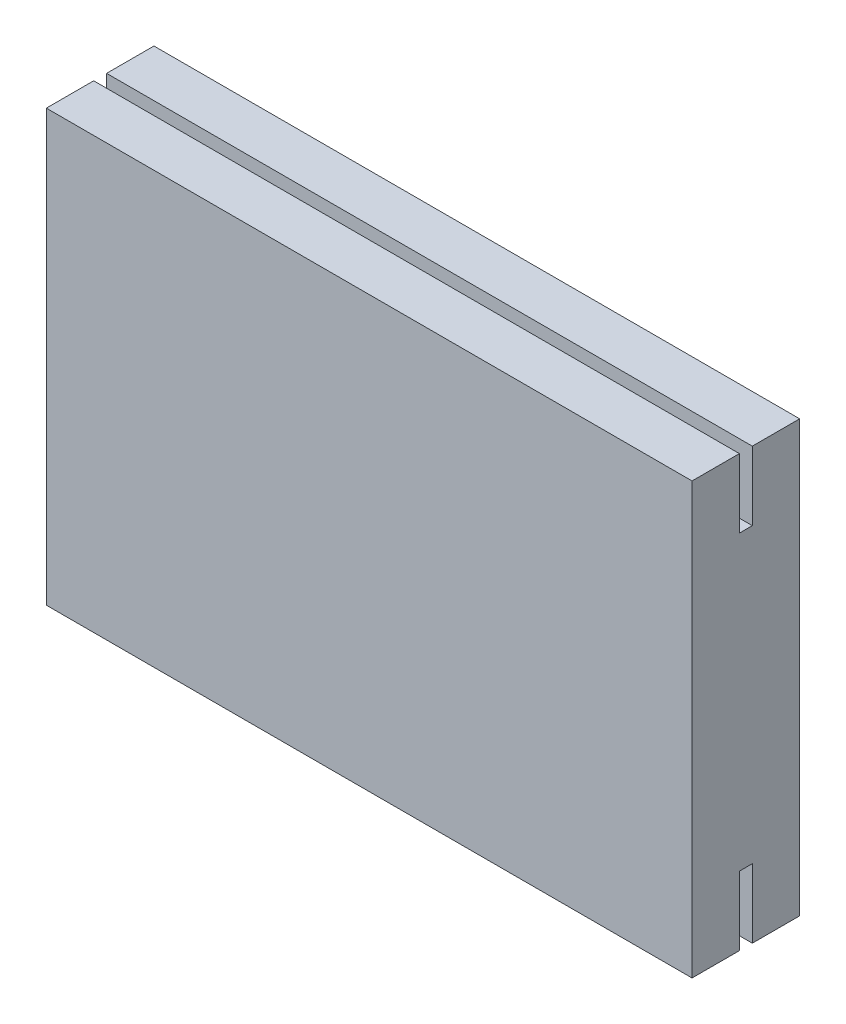
ISO-10303-21;
HEADER;
FILE_DESCRIPTION(('STEP AP214'),'2;1');
FILE_NAME('part.step','',(''),(''),'','','');
FILE_SCHEMA(('AUTOMOTIVE_DESIGN { 1 0 10303 214 1 1 1 1 }'));
ENDSEC;
DATA;
#1=APPLICATION_CONTEXT('core data for automotive mechanical design processes');
#2=APPLICATION_PROTOCOL_DEFINITION('international standard','automotive_design',2000,#1);
#3=PRODUCT_CONTEXT('',#1,'mechanical');
#4=PRODUCT('Part','Part','',(#3));
#5=PRODUCT_RELATED_PRODUCT_CATEGORY('part','',(#4));
#6=PRODUCT_DEFINITION_FORMATION('','',#4);
#7=PRODUCT_DEFINITION_CONTEXT('part definition',#1,'design');
#8=PRODUCT_DEFINITION('design','',#6,#7);
#9=PRODUCT_DEFINITION_SHAPE('','',#8);
#10=(LENGTH_UNIT() NAMED_UNIT(*) SI_UNIT(.MILLI.,.METRE.));
#11=(NAMED_UNIT(*) PLANE_ANGLE_UNIT() SI_UNIT($,.RADIAN.));
#12=(NAMED_UNIT(*) SI_UNIT($,.STERADIAN.) SOLID_ANGLE_UNIT());
#13=UNCERTAINTY_MEASURE_WITH_UNIT(LENGTH_MEASURE(1.E-05),#10,'distance_accuracy_value','');
#14=(GEOMETRIC_REPRESENTATION_CONTEXT(3) GLOBAL_UNCERTAINTY_ASSIGNED_CONTEXT((#13)) GLOBAL_UNIT_ASSIGNED_CONTEXT((#10,
#11,#12)) REPRESENTATION_CONTEXT('',''));
#15=CARTESIAN_POINT('',(0.,0.,0.));
#16=DIRECTION('',(0.,0.,1.));
#17=DIRECTION('',(1.,0.,0.));
#18=AXIS2_PLACEMENT_3D('',#15,#16,#17);
#19=CARTESIAN_POINT('',(30.,-10.,-2.5));
#20=DIRECTION('',(0.,1.,0.));
#21=DIRECTION('',(0.,0.,1.));
#22=AXIS2_PLACEMENT_3D('',#19,#20,#21);
#23=PLANE('',#22);
#24=DIRECTION('',(1.,0.,0.));
#25=VECTOR('',#24,1.);
#26=CARTESIAN_POINT('',(0.,-10.,0.3));
#27=LINE('',#26,#25);
#28=CARTESIAN_POINT('',(0.,-10.,0.3));
#29=VERTEX_POINT('',#28);
#30=CARTESIAN_POINT('',(30.,-10.,0.3));
#31=VERTEX_POINT('',#30);
#32=EDGE_CURVE('E61',#29,#31,#27,.T.);
#33=ORIENTED_EDGE('',*,*,#32,.T.);
#34=DIRECTION('',(0.,0.,-1.));
#35=VECTOR('',#34,1.);
#36=CARTESIAN_POINT('',(30.,-10.,-2.5));
#37=LINE('',#36,#35);
#38=CARTESIAN_POINT('',(30.,-10.,2.5));
#39=VERTEX_POINT('',#38);
#40=EDGE_CURVE('E218',#39,#31,#37,.T.);
#41=ORIENTED_EDGE('',*,*,#40,.F.);
#42=DIRECTION('',(-1.,0.,0.));
#43=VECTOR('',#42,1.);
#44=CARTESIAN_POINT('',(30.,-10.,2.5));
#45=LINE('',#44,#43);
#46=CARTESIAN_POINT('',(0.,-10.,2.5));
#47=VERTEX_POINT('',#46);
#48=EDGE_CURVE('E11',#39,#47,#45,.T.);
#49=ORIENTED_EDGE('',*,*,#48,.T.);
#50=DIRECTION('',(0.,0.,-1.));
#51=VECTOR('',#50,1.);
#52=CARTESIAN_POINT('',(0.,-10.,-2.5));
#53=LINE('',#52,#51);
#54=EDGE_CURVE('E235',#47,#29,#53,.T.);
#55=ORIENTED_EDGE('',*,*,#54,.T.);
#56=EDGE_LOOP('',(#33,#41,#49,#55));
#57=FACE_BOUND('',#56,.T.);
#58=ADVANCED_FACE('F45',(#57),#23,.F.);
#59=CARTESIAN_POINT('',(30.,10.,-2.5));
#60=DIRECTION('',(0.,-1.,0.));
#61=DIRECTION('',(0.,0.,-1.));
#62=AXIS2_PLACEMENT_3D('',#59,#60,#61);
#63=PLANE('',#62);
#64=DIRECTION('',(1.,0.,0.));
#65=VECTOR('',#64,1.);
#66=CARTESIAN_POINT('',(0.,10.,-0.3));
#67=LINE('',#66,#65);
#68=CARTESIAN_POINT('',(0.,10.,-0.3));
#69=VERTEX_POINT('',#68);
#70=CARTESIAN_POINT('',(30.,10.,-0.3));
#71=VERTEX_POINT('',#70);
#72=EDGE_CURVE('E69',#69,#71,#67,.T.);
#73=ORIENTED_EDGE('',*,*,#72,.T.);
#74=DIRECTION('',(0.,0.,1.));
#75=VECTOR('',#74,1.);
#76=CARTESIAN_POINT('',(30.,10.,-2.5));
#77=LINE('',#76,#75);
#78=CARTESIAN_POINT('',(30.,10.,-2.5));
#79=VERTEX_POINT('',#78);
#80=EDGE_CURVE('E226',#79,#71,#77,.T.);
#81=ORIENTED_EDGE('',*,*,#80,.F.);
#82=DIRECTION('',(-1.,0.,0.));
#83=VECTOR('',#82,1.);
#84=CARTESIAN_POINT('',(30.,10.,-2.5));
#85=LINE('',#84,#83);
#86=CARTESIAN_POINT('',(0.,10.,-2.5));
#87=VERTEX_POINT('',#86);
#88=EDGE_CURVE('E248',#79,#87,#85,.T.);
#89=ORIENTED_EDGE('',*,*,#88,.T.);
#90=DIRECTION('',(0.,0.,1.));
#91=VECTOR('',#90,1.);
#92=CARTESIAN_POINT('',(0.,10.,-2.5));
#93=LINE('',#92,#91);
#94=EDGE_CURVE('E217',#87,#69,#93,.T.);
#95=ORIENTED_EDGE('',*,*,#94,.T.);
#96=EDGE_LOOP('',(#73,#81,#89,#95));
#97=FACE_BOUND('',#96,.T.);
#98=ADVANCED_FACE('F263',(#97),#63,.F.);
#99=CARTESIAN_POINT('',(30.,-10.,2.5));
#100=DIRECTION('',(0.,0.,-1.));
#101=DIRECTION('',(-1.,0.,0.));
#102=AXIS2_PLACEMENT_3D('',#99,#100,#101);
#103=PLANE('',#102);
#104=DIRECTION('',(0.,-1.,0.));
#105=VECTOR('',#104,1.);
#106=CARTESIAN_POINT('',(0.,-10.,2.5));
#107=LINE('',#106,#105);
#108=CARTESIAN_POINT('',(0.,10.,2.5));
#109=VERTEX_POINT('',#108);
#110=EDGE_CURVE('E204',#109,#47,#107,.T.);
#111=ORIENTED_EDGE('',*,*,#110,.T.);
#112=ORIENTED_EDGE('',*,*,#48,.F.);
#113=DIRECTION('',(0.,-1.,0.));
#114=VECTOR('',#113,1.);
#115=CARTESIAN_POINT('',(30.,-10.,2.5));
#116=LINE('',#115,#114);
#117=CARTESIAN_POINT('',(30.,10.,2.5));
#118=VERTEX_POINT('',#117);
#119=EDGE_CURVE('E212',#118,#39,#116,.T.);
#120=ORIENTED_EDGE('',*,*,#119,.F.);
#121=DIRECTION('',(-1.,0.,0.));
#122=VECTOR('',#121,1.);
#123=CARTESIAN_POINT('',(30.,10.,2.5));
#124=LINE('',#123,#122);
#125=EDGE_CURVE('E230',#118,#109,#124,.T.);
#126=ORIENTED_EDGE('',*,*,#125,.T.);
#127=EDGE_LOOP('',(#111,#112,#120,#126));
#128=FACE_BOUND('',#127,.T.);
#129=ADVANCED_FACE('F47',(#128),#103,.F.);
#130=CARTESIAN_POINT('',(30.,-10.,-0.3));
#131=VERTEX_POINT('',#130);
#132=CARTESIAN_POINT('',(30.,-10.,-2.5));
#133=VERTEX_POINT('',#132);
#134=EDGE_CURVE('E216',#131,#133,#37,.T.);
#135=ORIENTED_EDGE('',*,*,#134,.F.);
#136=DIRECTION('',(1.,0.,0.));
#137=VECTOR('',#136,1.);
#138=CARTESIAN_POINT('',(0.,-10.,-0.3));
#139=LINE('',#138,#137);
#140=CARTESIAN_POINT('',(0.,-10.,-0.3));
#141=VERTEX_POINT('',#140);
#142=EDGE_CURVE('E173',#141,#131,#139,.T.);
#143=ORIENTED_EDGE('',*,*,#142,.F.);
#144=CARTESIAN_POINT('',(0.,-10.,-2.5));
#145=VERTEX_POINT('',#144);
#146=EDGE_CURVE('E234',#141,#145,#53,.T.);
#147=ORIENTED_EDGE('',*,*,#146,.T.);
#148=DIRECTION('',(-1.,0.,0.));
#149=VECTOR('',#148,1.);
#150=CARTESIAN_POINT('',(30.,-10.,-2.5));
#151=LINE('',#150,#149);
#152=EDGE_CURVE('E54',#133,#145,#151,.T.);
#153=ORIENTED_EDGE('',*,*,#152,.F.);
#154=EDGE_LOOP('',(#135,#143,#147,#153));
#155=FACE_BOUND('',#154,.T.);
#156=ADVANCED_FACE('F273',(#155),#23,.F.);
#157=CARTESIAN_POINT('',(30.,-10.,-2.5));
#158=DIRECTION('',(0.,0.,1.));
#159=DIRECTION('',(1.,0.,0.));
#160=AXIS2_PLACEMENT_3D('',#157,#158,#159);
#161=PLANE('',#160);
#162=DIRECTION('',(0.,1.,0.));
#163=VECTOR('',#162,1.);
#164=CARTESIAN_POINT('',(0.,-10.,-2.5));
#165=LINE('',#164,#163);
#166=EDGE_CURVE('E238',#145,#87,#165,.T.);
#167=ORIENTED_EDGE('',*,*,#166,.T.);
#168=ORIENTED_EDGE('',*,*,#88,.F.);
#169=DIRECTION('',(0.,1.,0.));
#170=VECTOR('',#169,1.);
#171=CARTESIAN_POINT('',(30.,-10.,-2.5));
#172=LINE('',#171,#170);
#173=EDGE_CURVE('E222',#133,#79,#172,.T.);
#174=ORIENTED_EDGE('',*,*,#173,.F.);
#175=ORIENTED_EDGE('',*,*,#152,.T.);
#176=EDGE_LOOP('',(#167,#168,#174,#175));
#177=FACE_BOUND('',#176,.T.);
#178=ADVANCED_FACE('F257',(#177),#161,.F.);
#179=CARTESIAN_POINT('',(30.,10.,0.3));
#180=VERTEX_POINT('',#179);
#181=EDGE_CURVE('E225',#180,#118,#77,.T.);
#182=ORIENTED_EDGE('',*,*,#181,.F.);
#183=DIRECTION('',(1.,0.,0.));
#184=VECTOR('',#183,1.);
#185=CARTESIAN_POINT('',(0.,10.,0.3));
#186=LINE('',#185,#184);
#187=CARTESIAN_POINT('',(0.,10.,0.3));
#188=VERTEX_POINT('',#187);
#189=EDGE_CURVE('E205',#188,#180,#186,.T.);
#190=ORIENTED_EDGE('',*,*,#189,.F.);
#191=EDGE_CURVE('E241',#188,#109,#93,.T.);
#192=ORIENTED_EDGE('',*,*,#191,.T.);
#193=ORIENTED_EDGE('',*,*,#125,.F.);
#194=EDGE_LOOP('',(#182,#190,#192,#193));
#195=FACE_BOUND('',#194,.T.);
#196=ADVANCED_FACE('F285',(#195),#63,.F.);
#197=CARTESIAN_POINT('',(30.,0.,0.));
#198=DIRECTION('',(1.,0.,0.));
#199=DIRECTION('',(0.,0.,-1.));
#200=AXIS2_PLACEMENT_3D('',#197,#198,#199);
#201=PLANE('',#200);
#202=DIRECTION('',(0.,1.,0.));
#203=VECTOR('',#202,1.);
#204=CARTESIAN_POINT('',(30.,0.,-0.300000000000001));
#205=LINE('',#204,#203);
#206=CARTESIAN_POINT('',(30.,-6.8,-0.3));
#207=VERTEX_POINT('',#206);
#208=EDGE_CURVE('E156',#131,#207,#205,.T.);
#209=ORIENTED_EDGE('',*,*,#208,.F.);
#210=ORIENTED_EDGE('',*,*,#134,.T.);
#211=ORIENTED_EDGE('',*,*,#173,.T.);
#212=ORIENTED_EDGE('',*,*,#80,.T.);
#213=DIRECTION('',(0.,-1.,0.));
#214=VECTOR('',#213,1.);
#215=CARTESIAN_POINT('',(30.,0.,-0.300000000000001));
#216=LINE('',#215,#214);
#217=CARTESIAN_POINT('',(30.,6.8,-0.3));
#218=VERTEX_POINT('',#217);
#219=EDGE_CURVE('E194',#71,#218,#216,.T.);
#220=ORIENTED_EDGE('',*,*,#219,.T.);
#221=DIRECTION('',(0.,0.,-1.));
#222=VECTOR('',#221,1.);
#223=CARTESIAN_POINT('',(30.,6.8,0.));
#224=LINE('',#223,#222);
#225=CARTESIAN_POINT('',(30.,6.8,0.3));
#226=VERTEX_POINT('',#225);
#227=EDGE_CURVE('E172',#226,#218,#224,.T.);
#228=ORIENTED_EDGE('',*,*,#227,.F.);
#229=DIRECTION('',(0.,-1.,0.));
#230=VECTOR('',#229,1.);
#231=CARTESIAN_POINT('',(30.,0.,0.299999999999999));
#232=LINE('',#231,#230);
#233=EDGE_CURVE('E183',#180,#226,#232,.T.);
#234=ORIENTED_EDGE('',*,*,#233,.F.);
#235=ORIENTED_EDGE('',*,*,#181,.T.);
#236=ORIENTED_EDGE('',*,*,#119,.T.);
#237=ORIENTED_EDGE('',*,*,#40,.T.);
#238=DIRECTION('',(0.,1.,0.));
#239=VECTOR('',#238,1.);
#240=CARTESIAN_POINT('',(30.,0.,0.299999999999999));
#241=LINE('',#240,#239);
#242=CARTESIAN_POINT('',(30.,-6.8,0.3));
#243=VERTEX_POINT('',#242);
#244=EDGE_CURVE('E160',#31,#243,#241,.T.);
#245=ORIENTED_EDGE('',*,*,#244,.T.);
#246=DIRECTION('',(0.,0.,-1.));
#247=VECTOR('',#246,1.);
#248=CARTESIAN_POINT('',(30.,-6.8,0.));
#249=LINE('',#248,#247);
#250=EDGE_CURVE('E148',#243,#207,#249,.T.);
#251=ORIENTED_EDGE('',*,*,#250,.T.);
#252=EDGE_LOOP('',(#209,#210,#211,#212,#220,#228,#234,#235,#236,#237,#245,#251));
#253=FACE_BOUND('',#252,.T.);
#254=ADVANCED_FACE('F267',(#253),#201,.T.);
#255=CARTESIAN_POINT('',(0.,0.,0.));
#256=DIRECTION('',(1.,0.,0.));
#257=DIRECTION('',(0.,0.,-1.));
#258=AXIS2_PLACEMENT_3D('',#255,#256,#257);
#259=PLANE('',#258);
#260=ORIENTED_EDGE('',*,*,#146,.F.);
#261=DIRECTION('',(0.,1.,0.));
#262=VECTOR('',#261,1.);
#263=CARTESIAN_POINT('',(0.,0.,-0.300000000000001));
#264=LINE('',#263,#262);
#265=CARTESIAN_POINT('',(0.,-6.8,-0.3));
#266=VERTEX_POINT('',#265);
#267=EDGE_CURVE('E141',#141,#266,#264,.T.);
#268=ORIENTED_EDGE('',*,*,#267,.T.);
#269=DIRECTION('',(0.,0.,-1.));
#270=VECTOR('',#269,1.);
#271=CARTESIAN_POINT('',(0.,-6.8,0.));
#272=LINE('',#271,#270);
#273=CARTESIAN_POINT('',(0.,-6.8,0.3));
#274=VERTEX_POINT('',#273);
#275=EDGE_CURVE('E142',#274,#266,#272,.T.);
#276=ORIENTED_EDGE('',*,*,#275,.F.);
#277=DIRECTION('',(0.,1.,0.));
#278=VECTOR('',#277,1.);
#279=CARTESIAN_POINT('',(0.,0.,0.299999999999999));
#280=LINE('',#279,#278);
#281=EDGE_CURVE('E132',#29,#274,#280,.T.);
#282=ORIENTED_EDGE('',*,*,#281,.F.);
#283=ORIENTED_EDGE('',*,*,#54,.F.);
#284=ORIENTED_EDGE('',*,*,#110,.F.);
#285=ORIENTED_EDGE('',*,*,#191,.F.);
#286=DIRECTION('',(0.,-1.,0.));
#287=VECTOR('',#286,1.);
#288=CARTESIAN_POINT('',(0.,0.,0.299999999999999));
#289=LINE('',#288,#287);
#290=CARTESIAN_POINT('',(0.,6.8,0.3));
#291=VERTEX_POINT('',#290);
#292=EDGE_CURVE('E186',#188,#291,#289,.T.);
#293=ORIENTED_EDGE('',*,*,#292,.T.);
#294=DIRECTION('',(0.,0.,-1.));
#295=VECTOR('',#294,1.);
#296=CARTESIAN_POINT('',(0.,6.8,0.));
#297=LINE('',#296,#295);
#298=CARTESIAN_POINT('',(0.,6.8,-0.3));
#299=VERTEX_POINT('',#298);
#300=EDGE_CURVE('E178',#291,#299,#297,.T.);
#301=ORIENTED_EDGE('',*,*,#300,.T.);
#302=DIRECTION('',(0.,-1.,0.));
#303=VECTOR('',#302,1.);
#304=CARTESIAN_POINT('',(0.,0.,-0.300000000000001));
#305=LINE('',#304,#303);
#306=EDGE_CURVE('E182',#69,#299,#305,.T.);
#307=ORIENTED_EDGE('',*,*,#306,.F.);
#308=ORIENTED_EDGE('',*,*,#94,.F.);
#309=ORIENTED_EDGE('',*,*,#166,.F.);
#310=EDGE_LOOP('',(#260,#268,#276,#282,#283,#284,#285,#293,#301,#307,#308,#309));
#311=FACE_BOUND('',#310,.T.);
#312=ADVANCED_FACE('F154',(#311),#259,.F.);
#313=CARTESIAN_POINT('',(0.,6.8,0.));
#314=DIRECTION('',(0.,-1.,0.));
#315=DIRECTION('',(0.,0.,-1.));
#316=AXIS2_PLACEMENT_3D('',#313,#314,#315);
#317=PLANE('',#316);
#318=ORIENTED_EDGE('',*,*,#227,.T.);
#319=DIRECTION('',(1.,0.,0.));
#320=VECTOR('',#319,1.);
#321=CARTESIAN_POINT('',(0.,6.8,-0.3));
#322=LINE('',#321,#320);
#323=EDGE_CURVE('E190',#299,#218,#322,.T.);
#324=ORIENTED_EDGE('',*,*,#323,.F.);
#325=ORIENTED_EDGE('',*,*,#300,.F.);
#326=DIRECTION('',(1.,0.,0.));
#327=VECTOR('',#326,1.);
#328=CARTESIAN_POINT('',(0.,6.8,0.3));
#329=LINE('',#328,#327);
#330=EDGE_CURVE('E201',#291,#226,#329,.T.);
#331=ORIENTED_EDGE('',*,*,#330,.T.);
#332=EDGE_LOOP('',(#318,#324,#325,#331));
#333=FACE_BOUND('',#332,.T.);
#334=ADVANCED_FACE('F292',(#333),#317,.F.);
#335=CARTESIAN_POINT('',(0.,0.,0.299999999999999));
#336=DIRECTION('',(0.,0.,1.));
#337=DIRECTION('',(0.,-1.,0.));
#338=AXIS2_PLACEMENT_3D('',#335,#336,#337);
#339=PLANE('',#338);
#340=ORIENTED_EDGE('',*,*,#233,.T.);
#341=ORIENTED_EDGE('',*,*,#330,.F.);
#342=ORIENTED_EDGE('',*,*,#292,.F.);
#343=ORIENTED_EDGE('',*,*,#189,.T.);
#344=EDGE_LOOP('',(#340,#341,#342,#343));
#345=FACE_BOUND('',#344,.T.);
#346=ADVANCED_FACE('F289',(#345),#339,.F.);
#347=CARTESIAN_POINT('',(0.,0.,-0.300000000000001));
#348=DIRECTION('',(0.,0.,1.));
#349=DIRECTION('',(0.,-1.,0.));
#350=AXIS2_PLACEMENT_3D('',#347,#348,#349);
#351=PLANE('',#350);
#352=ORIENTED_EDGE('',*,*,#219,.F.);
#353=ORIENTED_EDGE('',*,*,#72,.F.);
#354=ORIENTED_EDGE('',*,*,#306,.T.);
#355=ORIENTED_EDGE('',*,*,#323,.T.);
#356=EDGE_LOOP('',(#352,#353,#354,#355));
#357=FACE_BOUND('',#356,.T.);
#358=ADVANCED_FACE('F294',(#357),#351,.T.);
#359=CARTESIAN_POINT('',(0.,-6.8,0.));
#360=DIRECTION('',(0.,-1.,0.));
#361=DIRECTION('',(0.,0.,-1.));
#362=AXIS2_PLACEMENT_3D('',#359,#360,#361);
#363=PLANE('',#362);
#364=ORIENTED_EDGE('',*,*,#250,.F.);
#365=DIRECTION('',(1.,0.,0.));
#366=VECTOR('',#365,1.);
#367=CARTESIAN_POINT('',(0.,-6.8,0.3));
#368=LINE('',#367,#366);
#369=EDGE_CURVE('E135',#274,#243,#368,.T.);
#370=ORIENTED_EDGE('',*,*,#369,.F.);
#371=ORIENTED_EDGE('',*,*,#275,.T.);
#372=DIRECTION('',(1.,0.,0.));
#373=VECTOR('',#372,1.);
#374=CARTESIAN_POINT('',(0.,-6.8,-0.3));
#375=LINE('',#374,#373);
#376=EDGE_CURVE('E169',#266,#207,#375,.T.);
#377=ORIENTED_EDGE('',*,*,#376,.T.);
#378=EDGE_LOOP('',(#364,#370,#371,#377));
#379=FACE_BOUND('',#378,.T.);
#380=ADVANCED_FACE('F145',(#379),#363,.T.);
#381=CARTESIAN_POINT('',(0.,0.,-0.300000000000001));
#382=DIRECTION('',(0.,0.,-1.));
#383=DIRECTION('',(0.,1.,0.));
#384=AXIS2_PLACEMENT_3D('',#381,#382,#383);
#385=PLANE('',#384);
#386=ORIENTED_EDGE('',*,*,#208,.T.);
#387=ORIENTED_EDGE('',*,*,#376,.F.);
#388=ORIENTED_EDGE('',*,*,#267,.F.);
#389=ORIENTED_EDGE('',*,*,#142,.T.);
#390=EDGE_LOOP('',(#386,#387,#388,#389));
#391=FACE_BOUND('',#390,.T.);
#392=ADVANCED_FACE('F275',(#391),#385,.F.);
#393=CARTESIAN_POINT('',(0.,0.,0.299999999999999));
#394=DIRECTION('',(0.,0.,-1.));
#395=DIRECTION('',(0.,1.,0.));
#396=AXIS2_PLACEMENT_3D('',#393,#394,#395);
#397=PLANE('',#396);
#398=ORIENTED_EDGE('',*,*,#244,.F.);
#399=ORIENTED_EDGE('',*,*,#32,.F.);
#400=ORIENTED_EDGE('',*,*,#281,.T.);
#401=ORIENTED_EDGE('',*,*,#369,.T.);
#402=EDGE_LOOP('',(#398,#399,#400,#401));
#403=FACE_BOUND('',#402,.T.);
#404=ADVANCED_FACE('F134',(#403),#397,.T.);
#405=CLOSED_SHELL('',(#58,#98,#129,#156,#178,#196,#254,#312,#334,#346,#358,#380,#392,#404));
#406=MANIFOLD_SOLID_BREP('B2',#405);
#407=ADVANCED_BREP_SHAPE_REPRESENTATION('',(#18,#406),#14);
#408=SHAPE_DEFINITION_REPRESENTATION(#9,#407);
ENDSEC;
END-ISO-10303-21;
